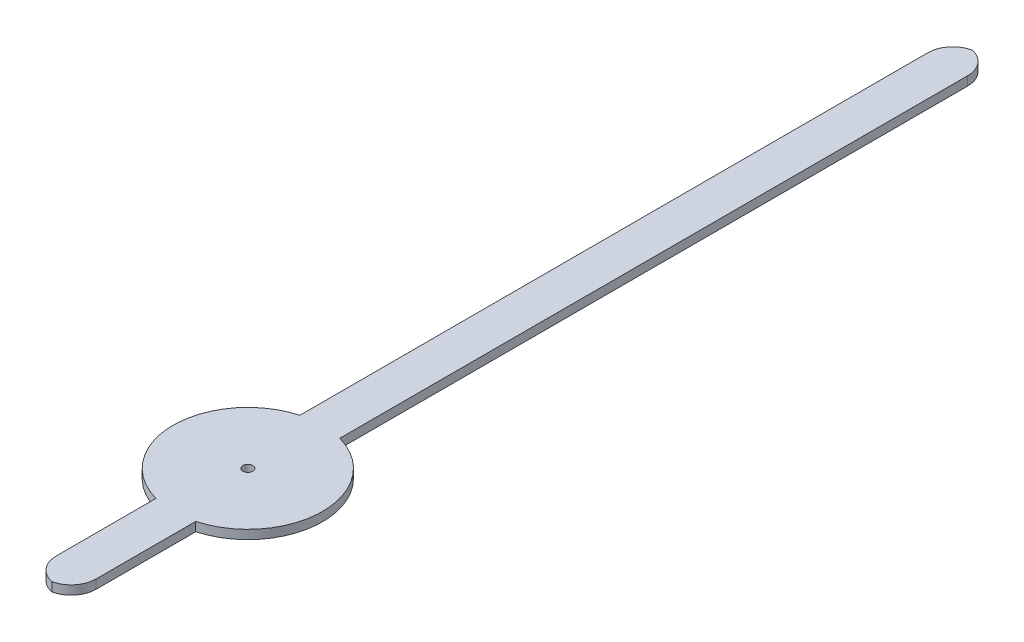
ISO-10303-21;
HEADER;
FILE_DESCRIPTION(('STEP AP214'),'2;1');
FILE_NAME('part.step','',(''),(''),'','','');
FILE_SCHEMA(('AUTOMOTIVE_DESIGN { 1 0 10303 214 1 1 1 1 }'));
ENDSEC;
DATA;
#1=APPLICATION_CONTEXT('core data for automotive mechanical design processes');
#2=APPLICATION_PROTOCOL_DEFINITION('international standard','automotive_design',2000,#1);
#3=PRODUCT_CONTEXT('',#1,'mechanical');
#4=PRODUCT('Part','Part','',(#3));
#5=PRODUCT_RELATED_PRODUCT_CATEGORY('part','',(#4));
#6=PRODUCT_DEFINITION_FORMATION('','',#4);
#7=PRODUCT_DEFINITION_CONTEXT('part definition',#1,'design');
#8=PRODUCT_DEFINITION('design','',#6,#7);
#9=PRODUCT_DEFINITION_SHAPE('','',#8);
#10=(LENGTH_UNIT() NAMED_UNIT(*) SI_UNIT(.MILLI.,.METRE.));
#11=(NAMED_UNIT(*) PLANE_ANGLE_UNIT() SI_UNIT($,.RADIAN.));
#12=(NAMED_UNIT(*) SI_UNIT($,.STERADIAN.) SOLID_ANGLE_UNIT());
#13=UNCERTAINTY_MEASURE_WITH_UNIT(LENGTH_MEASURE(1.E-05),#10,'distance_accuracy_value','');
#14=(GEOMETRIC_REPRESENTATION_CONTEXT(3) GLOBAL_UNCERTAINTY_ASSIGNED_CONTEXT((#13)) GLOBAL_UNIT_ASSIGNED_CONTEXT((#10,
#11,#12)) REPRESENTATION_CONTEXT('',''));
#15=CARTESIAN_POINT('',(0.,0.,0.));
#16=DIRECTION('',(0.,0.,1.));
#17=DIRECTION('',(1.,0.,0.));
#18=AXIS2_PLACEMENT_3D('',#15,#16,#17);
#19=CARTESIAN_POINT('',(0.,0.18,0.));
#20=DIRECTION('',(0.,1.,0.));
#21=DIRECTION('',(0.,0.,1.));
#22=AXIS2_PLACEMENT_3D('',#19,#20,#21);
#23=PLANE('',#22);
#24=CARTESIAN_POINT('',(-0.0999999999999999,0.18,-14.0543167705199));
#25=DIRECTION('',(0.,1.,0.));
#26=DIRECTION('',(0.,0.,1.));
#27=AXIS2_PLACEMENT_3D('',#24,#25,#26);
#28=CIRCLE('',#27,0.5);
#29=CARTESIAN_POINT('',(0.4,0.18,-14.0543167705199));
#30=VERTEX_POINT('',#29);
#31=CARTESIAN_POINT('',(0.,0.18,-14.5442147190765));
#32=VERTEX_POINT('',#31);
#33=EDGE_CURVE('E61',#30,#32,#28,.T.);
#34=ORIENTED_EDGE('',*,*,#33,.T.);
#35=CARTESIAN_POINT('',(0.0999999999999999,0.18,-14.0543167705199));
#36=DIRECTION('',(0.,1.,0.));
#37=DIRECTION('',(0.,0.,1.));
#38=AXIS2_PLACEMENT_3D('',#35,#36,#37);
#39=CIRCLE('',#38,0.5);
#40=CARTESIAN_POINT('',(-0.4,0.18,-14.0543167705199));
#41=VERTEX_POINT('',#40);
#42=EDGE_CURVE('E212',#32,#41,#39,.T.);
#43=ORIENTED_EDGE('',*,*,#42,.T.);
#44=DIRECTION('',(0.,0.,1.));
#45=VECTOR('',#44,1.);
#46=CARTESIAN_POINT('',(-0.4,0.18,-1.4456832294801));
#47=LINE('',#46,#45);
#48=CARTESIAN_POINT('',(-0.4,0.18,-1.4456832294801));
#49=VERTEX_POINT('',#48);
#50=EDGE_CURVE('E150',#41,#49,#47,.T.);
#51=ORIENTED_EDGE('',*,*,#50,.T.);
#52=CARTESIAN_POINT('',(0.,0.18,0.));
#53=DIRECTION('',(0.,1.,0.));
#54=DIRECTION('',(0.,0.,1.));
#55=AXIS2_PLACEMENT_3D('',#52,#53,#54);
#56=CIRCLE('',#55,1.5);
#57=CARTESIAN_POINT('',(-0.4,0.18,1.4456832294801));
#58=VERTEX_POINT('',#57);
#59=EDGE_CURVE('E156',#49,#58,#56,.T.);
#60=ORIENTED_EDGE('',*,*,#59,.T.);
#61=DIRECTION('',(0.,0.,1.));
#62=VECTOR('',#61,1.);
#63=CARTESIAN_POINT('',(-0.4,0.18,3.9456832294801));
#64=LINE('',#63,#62);
#65=CARTESIAN_POINT('',(-0.4,0.18,3.4456832294801));
#66=VERTEX_POINT('',#65);
#67=EDGE_CURVE('E159',#58,#66,#64,.T.);
#68=ORIENTED_EDGE('',*,*,#67,.T.);
#69=CARTESIAN_POINT('',(0.0999999999999998,0.18,3.4456832294801));
#70=DIRECTION('',(0.,1.,0.));
#71=DIRECTION('',(0.,0.,1.));
#72=AXIS2_PLACEMENT_3D('',#69,#70,#71);
#73=CIRCLE('',#72,0.5);
#74=CARTESIAN_POINT('',(0.,0.18,3.93558117803673));
#75=VERTEX_POINT('',#74);
#76=EDGE_CURVE('E68',#66,#75,#73,.T.);
#77=ORIENTED_EDGE('',*,*,#76,.T.);
#78=CARTESIAN_POINT('',(-0.0999999999999999,0.18,3.4456832294801));
#79=DIRECTION('',(0.,1.,0.));
#80=DIRECTION('',(0.,0.,1.));
#81=AXIS2_PLACEMENT_3D('',#78,#79,#80);
#82=CIRCLE('',#81,0.5);
#83=CARTESIAN_POINT('',(0.4,0.18,3.4456832294801));
#84=VERTEX_POINT('',#83);
#85=EDGE_CURVE('E126',#75,#84,#82,.T.);
#86=ORIENTED_EDGE('',*,*,#85,.T.);
#87=DIRECTION('',(0.,0.,-1.));
#88=VECTOR('',#87,1.);
#89=CARTESIAN_POINT('',(0.4,0.18,3.9456832294801));
#90=LINE('',#89,#88);
#91=CARTESIAN_POINT('',(0.4,0.18,1.4456832294801));
#92=VERTEX_POINT('',#91);
#93=EDGE_CURVE('E120',#84,#92,#90,.T.);
#94=ORIENTED_EDGE('',*,*,#93,.T.);
#95=CARTESIAN_POINT('',(0.,0.18,0.));
#96=DIRECTION('',(0.,1.,0.));
#97=DIRECTION('',(0.,0.,1.));
#98=AXIS2_PLACEMENT_3D('',#95,#96,#97);
#99=CIRCLE('',#98,1.5);
#100=CARTESIAN_POINT('',(0.4,0.18,-1.4456832294801));
#101=VERTEX_POINT('',#100);
#102=EDGE_CURVE('E124',#92,#101,#99,.T.);
#103=ORIENTED_EDGE('',*,*,#102,.T.);
#104=DIRECTION('',(0.,0.,-1.));
#105=VECTOR('',#104,1.);
#106=CARTESIAN_POINT('',(0.4,0.18,-1.4456832294801));
#107=LINE('',#106,#105);
#108=EDGE_CURVE('E147',#101,#30,#107,.T.);
#109=ORIENTED_EDGE('',*,*,#108,.T.);
#110=EDGE_LOOP('',(#34,#43,#51,#60,#68,#77,#86,#94,#103,#109));
#111=FACE_BOUND('',#110,.T.);
#112=CARTESIAN_POINT('',(0.,0.18,0.));
#113=DIRECTION('',(0.,1.,0.));
#114=DIRECTION('',(0.,0.,1.));
#115=AXIS2_PLACEMENT_3D('',#112,#113,#114);
#116=CIRCLE('',#115,0.1);
#117=CARTESIAN_POINT('',(0.,0.18,0.1));
#118=VERTEX_POINT('',#117);
#119=EDGE_CURVE('E166',#118,#118,#116,.T.);
#120=ORIENTED_EDGE('',*,*,#119,.F.);
#121=EDGE_LOOP('',(#120));
#122=FACE_BOUND('',#121,.T.);
#123=ADVANCED_FACE('F43',(#111,#122),#23,.T.);
#124=CARTESIAN_POINT('',(0.,0.,0.));
#125=DIRECTION('',(0.,1.,0.));
#126=DIRECTION('',(0.,0.,1.));
#127=AXIS2_PLACEMENT_3D('',#124,#125,#126);
#128=PLANE('',#127);
#129=DIRECTION('',(0.,0.,1.));
#130=VECTOR('',#129,1.);
#131=CARTESIAN_POINT('',(-0.4,0.,-1.4456832294801));
#132=LINE('',#131,#130);
#133=CARTESIAN_POINT('',(-0.4,0.,-14.0543167705199));
#134=VERTEX_POINT('',#133);
#135=CARTESIAN_POINT('',(-0.4,0.,-1.4456832294801));
#136=VERTEX_POINT('',#135);
#137=EDGE_CURVE('E173',#134,#136,#132,.T.);
#138=ORIENTED_EDGE('',*,*,#137,.F.);
#139=CARTESIAN_POINT('',(0.0999999999999999,0.,-14.0543167705199));
#140=DIRECTION('',(0.,1.,0.));
#141=DIRECTION('',(0.,0.,1.));
#142=AXIS2_PLACEMENT_3D('',#139,#140,#141);
#143=CIRCLE('',#142,0.5);
#144=CARTESIAN_POINT('',(0.,0.,-14.5442147190765));
#145=VERTEX_POINT('',#144);
#146=EDGE_CURVE('E203',#134,#145,#143,.F.);
#147=ORIENTED_EDGE('',*,*,#146,.T.);
#148=CARTESIAN_POINT('',(-0.0999999999999999,0.,-14.0543167705199));
#149=DIRECTION('',(0.,1.,0.));
#150=DIRECTION('',(0.,0.,1.));
#151=AXIS2_PLACEMENT_3D('',#148,#149,#150);
#152=CIRCLE('',#151,0.5);
#153=CARTESIAN_POINT('',(0.4,0.,-14.0543167705199));
#154=VERTEX_POINT('',#153);
#155=EDGE_CURVE('E200',#145,#154,#152,.F.);
#156=ORIENTED_EDGE('',*,*,#155,.T.);
#157=DIRECTION('',(0.,0.,-1.));
#158=VECTOR('',#157,1.);
#159=CARTESIAN_POINT('',(0.4,0.,-1.4456832294801));
#160=LINE('',#159,#158);
#161=CARTESIAN_POINT('',(0.4,0.,-1.4456832294801));
#162=VERTEX_POINT('',#161);
#163=EDGE_CURVE('E169',#162,#154,#160,.T.);
#164=ORIENTED_EDGE('',*,*,#163,.F.);
#165=CARTESIAN_POINT('',(0.,0.,0.));
#166=DIRECTION('',(0.,1.,0.));
#167=DIRECTION('',(0.,0.,1.));
#168=AXIS2_PLACEMENT_3D('',#165,#166,#167);
#169=CIRCLE('',#168,1.5);
#170=CARTESIAN_POINT('',(0.4,0.,1.4456832294801));
#171=VERTEX_POINT('',#170);
#172=EDGE_CURVE('E165',#171,#162,#169,.T.);
#173=ORIENTED_EDGE('',*,*,#172,.F.);
#174=DIRECTION('',(0.,0.,-1.));
#175=VECTOR('',#174,1.);
#176=CARTESIAN_POINT('',(0.4,0.,3.9456832294801));
#177=LINE('',#176,#175);
#178=CARTESIAN_POINT('',(0.4,0.,3.4456832294801));
#179=VERTEX_POINT('',#178);
#180=EDGE_CURVE('E136',#179,#171,#177,.T.);
#181=ORIENTED_EDGE('',*,*,#180,.F.);
#182=CARTESIAN_POINT('',(-0.0999999999999999,0.,3.4456832294801));
#183=DIRECTION('',(0.,1.,0.));
#184=DIRECTION('',(0.,0.,1.));
#185=AXIS2_PLACEMENT_3D('',#182,#183,#184);
#186=CIRCLE('',#185,0.5);
#187=CARTESIAN_POINT('',(0.,0.,3.93558117803673));
#188=VERTEX_POINT('',#187);
#189=EDGE_CURVE('E194',#179,#188,#186,.F.);
#190=ORIENTED_EDGE('',*,*,#189,.T.);
#191=CARTESIAN_POINT('',(0.0999999999999998,0.,3.4456832294801));
#192=DIRECTION('',(0.,1.,0.));
#193=DIRECTION('',(0.,0.,1.));
#194=AXIS2_PLACEMENT_3D('',#191,#192,#193);
#195=CIRCLE('',#194,0.5);
#196=CARTESIAN_POINT('',(-0.4,0.,3.4456832294801));
#197=VERTEX_POINT('',#196);
#198=EDGE_CURVE('E197',#188,#197,#195,.F.);
#199=ORIENTED_EDGE('',*,*,#198,.T.);
#200=DIRECTION('',(0.,0.,1.));
#201=VECTOR('',#200,1.);
#202=CARTESIAN_POINT('',(-0.4,0.,3.9456832294801));
#203=LINE('',#202,#201);
#204=CARTESIAN_POINT('',(-0.4,0.,1.4456832294801));
#205=VERTEX_POINT('',#204);
#206=EDGE_CURVE('E130',#205,#197,#203,.T.);
#207=ORIENTED_EDGE('',*,*,#206,.F.);
#208=CARTESIAN_POINT('',(0.,0.,0.));
#209=DIRECTION('',(0.,1.,0.));
#210=DIRECTION('',(0.,0.,1.));
#211=AXIS2_PLACEMENT_3D('',#208,#209,#210);
#212=CIRCLE('',#211,1.5);
#213=EDGE_CURVE('E176',#136,#205,#212,.T.);
#214=ORIENTED_EDGE('',*,*,#213,.F.);
#215=EDGE_LOOP('',(#138,#147,#156,#164,#173,#181,#190,#199,#207,#214));
#216=FACE_BOUND('',#215,.T.);
#217=CARTESIAN_POINT('',(0.,0.,0.));
#218=DIRECTION('',(0.,1.,0.));
#219=DIRECTION('',(0.,0.,1.));
#220=AXIS2_PLACEMENT_3D('',#217,#218,#219);
#221=CIRCLE('',#220,0.1);
#222=CARTESIAN_POINT('',(0.,0.,0.1));
#223=VERTEX_POINT('',#222);
#224=EDGE_CURVE('E223',#223,#223,#221,.T.);
#225=ORIENTED_EDGE('',*,*,#224,.T.);
#226=EDGE_LOOP('',(#225));
#227=FACE_BOUND('',#226,.T.);
#228=ADVANCED_FACE('F239',(#216,#227),#128,.F.);
#229=CARTESIAN_POINT('',(0.4,0.18,3.9456832294801));
#230=DIRECTION('',(-1.,0.,0.));
#231=DIRECTION('',(0.,0.,1.));
#232=AXIS2_PLACEMENT_3D('',#229,#230,#231);
#233=PLANE('',#232);
#234=ORIENTED_EDGE('',*,*,#93,.F.);
#235=DIRECTION('',(0.,-1.,0.));
#236=VECTOR('',#235,1.);
#237=CARTESIAN_POINT('',(0.4,0.18,3.4456832294801));
#238=LINE('',#237,#236);
#239=EDGE_CURVE('E11',#84,#179,#238,.T.);
#240=ORIENTED_EDGE('',*,*,#239,.T.);
#241=ORIENTED_EDGE('',*,*,#180,.T.);
#242=DIRECTION('',(0.,-1.,0.));
#243=VECTOR('',#242,1.);
#244=CARTESIAN_POINT('',(0.4,0.18,1.4456832294801));
#245=LINE('',#244,#243);
#246=EDGE_CURVE('E133',#92,#171,#245,.T.);
#247=ORIENTED_EDGE('',*,*,#246,.F.);
#248=EDGE_LOOP('',(#234,#240,#241,#247));
#249=FACE_BOUND('',#248,.T.);
#250=ADVANCED_FACE('F134',(#249),#233,.F.);
#251=CARTESIAN_POINT('',(0.,0.18,0.));
#252=DIRECTION('',(0.,-1.,0.));
#253=DIRECTION('',(0.,0.,-1.));
#254=AXIS2_PLACEMENT_3D('',#251,#252,#253);
#255=CYLINDRICAL_SURFACE('',#254,1.5);
#256=ORIENTED_EDGE('',*,*,#172,.T.);
#257=DIRECTION('',(0.,-1.,0.));
#258=VECTOR('',#257,1.);
#259=CARTESIAN_POINT('',(0.4,0.18,-1.4456832294801));
#260=LINE('',#259,#258);
#261=EDGE_CURVE('E141',#101,#162,#260,.T.);
#262=ORIENTED_EDGE('',*,*,#261,.F.);
#263=ORIENTED_EDGE('',*,*,#102,.F.);
#264=ORIENTED_EDGE('',*,*,#246,.T.);
#265=EDGE_LOOP('',(#256,#262,#263,#264));
#266=FACE_BOUND('',#265,.T.);
#267=ADVANCED_FACE('F143',(#266),#255,.T.);
#268=CARTESIAN_POINT('',(0.4,0.18,-1.4456832294801));
#269=DIRECTION('',(-1.,0.,0.));
#270=DIRECTION('',(0.,0.,1.));
#271=AXIS2_PLACEMENT_3D('',#268,#269,#270);
#272=PLANE('',#271);
#273=ORIENTED_EDGE('',*,*,#163,.T.);
#274=DIRECTION('',(0.,-1.,0.));
#275=VECTOR('',#274,1.);
#276=CARTESIAN_POINT('',(0.4,0.18,-14.0543167705199));
#277=LINE('',#276,#275);
#278=EDGE_CURVE('E215',#154,#30,#277,.F.);
#279=ORIENTED_EDGE('',*,*,#278,.T.);
#280=ORIENTED_EDGE('',*,*,#108,.F.);
#281=ORIENTED_EDGE('',*,*,#261,.T.);
#282=EDGE_LOOP('',(#273,#279,#280,#281));
#283=FACE_BOUND('',#282,.T.);
#284=ADVANCED_FACE('F243',(#283),#272,.F.);
#285=CARTESIAN_POINT('',(-0.4,0.18,-1.4456832294801));
#286=DIRECTION('',(1.,0.,0.));
#287=DIRECTION('',(0.,0.,-1.));
#288=AXIS2_PLACEMENT_3D('',#285,#286,#287);
#289=PLANE('',#288);
#290=ORIENTED_EDGE('',*,*,#50,.F.);
#291=DIRECTION('',(0.,-1.,0.));
#292=VECTOR('',#291,1.);
#293=CARTESIAN_POINT('',(-0.4,0.18,-14.0543167705199));
#294=LINE('',#293,#292);
#295=EDGE_CURVE('E140',#41,#134,#294,.T.);
#296=ORIENTED_EDGE('',*,*,#295,.T.);
#297=ORIENTED_EDGE('',*,*,#137,.T.);
#298=DIRECTION('',(0.,-1.,0.));
#299=VECTOR('',#298,1.);
#300=CARTESIAN_POINT('',(-0.4,0.18,-1.4456832294801));
#301=LINE('',#300,#299);
#302=EDGE_CURVE('E185',#49,#136,#301,.T.);
#303=ORIENTED_EDGE('',*,*,#302,.F.);
#304=EDGE_LOOP('',(#290,#296,#297,#303));
#305=FACE_BOUND('',#304,.T.);
#306=ADVANCED_FACE('F253',(#305),#289,.F.);
#307=CARTESIAN_POINT('',(0.,0.18,0.));
#308=DIRECTION('',(0.,-1.,0.));
#309=DIRECTION('',(0.,0.,-1.));
#310=AXIS2_PLACEMENT_3D('',#307,#308,#309);
#311=CYLINDRICAL_SURFACE('',#310,1.5);
#312=ORIENTED_EDGE('',*,*,#213,.T.);
#313=DIRECTION('',(0.,-1.,0.));
#314=VECTOR('',#313,1.);
#315=CARTESIAN_POINT('',(-0.4,0.18,1.4456832294801));
#316=LINE('',#315,#314);
#317=EDGE_CURVE('E162',#58,#205,#316,.T.);
#318=ORIENTED_EDGE('',*,*,#317,.F.);
#319=ORIENTED_EDGE('',*,*,#59,.F.);
#320=ORIENTED_EDGE('',*,*,#302,.T.);
#321=EDGE_LOOP('',(#312,#318,#319,#320));
#322=FACE_BOUND('',#321,.T.);
#323=ADVANCED_FACE('F258',(#322),#311,.T.);
#324=CARTESIAN_POINT('',(-0.4,0.18,3.9456832294801));
#325=DIRECTION('',(1.,0.,0.));
#326=DIRECTION('',(0.,0.,-1.));
#327=AXIS2_PLACEMENT_3D('',#324,#325,#326);
#328=PLANE('',#327);
#329=ORIENTED_EDGE('',*,*,#206,.T.);
#330=DIRECTION('',(0.,-1.,0.));
#331=VECTOR('',#330,1.);
#332=CARTESIAN_POINT('',(-0.4,0.18,3.4456832294801));
#333=LINE('',#332,#331);
#334=EDGE_CURVE('E53',#197,#66,#333,.F.);
#335=ORIENTED_EDGE('',*,*,#334,.T.);
#336=ORIENTED_EDGE('',*,*,#67,.F.);
#337=ORIENTED_EDGE('',*,*,#317,.T.);
#338=EDGE_LOOP('',(#329,#335,#336,#337));
#339=FACE_BOUND('',#338,.T.);
#340=ADVANCED_FACE('F261',(#339),#328,.F.);
#341=CARTESIAN_POINT('',(0.,0.18,0.));
#342=DIRECTION('',(0.,-1.,0.));
#343=DIRECTION('',(0.,0.,-1.));
#344=AXIS2_PLACEMENT_3D('',#341,#342,#343);
#345=CYLINDRICAL_SURFACE('',#344,0.1);
#346=ORIENTED_EDGE('',*,*,#119,.T.);
#347=EDGE_LOOP('',(#346));
#348=FACE_BOUND('',#347,.T.);
#349=ORIENTED_EDGE('',*,*,#224,.F.);
#350=EDGE_LOOP('',(#349));
#351=FACE_BOUND('',#350,.T.);
#352=ADVANCED_FACE('F264',(#348,#351),#345,.F.);
#353=CARTESIAN_POINT('',(-0.0999999999999999,0.18,-14.0543167705199));
#354=DIRECTION('',(0.,-1.,0.));
#355=DIRECTION('',(0.,0.,-1.));
#356=AXIS2_PLACEMENT_3D('',#353,#354,#355);
#357=CYLINDRICAL_SURFACE('',#356,0.5);
#358=DIRECTION('',(0.,-1.,0.));
#359=VECTOR('',#358,1.);
#360=CARTESIAN_POINT('',(0.,0.09,-14.5442147190765));
#361=LINE('',#360,#359);
#362=EDGE_CURVE('E220',#32,#145,#361,.T.);
#363=ORIENTED_EDGE('',*,*,#362,.F.);
#364=ORIENTED_EDGE('',*,*,#33,.F.);
#365=ORIENTED_EDGE('',*,*,#278,.F.);
#366=ORIENTED_EDGE('',*,*,#155,.F.);
#367=EDGE_LOOP('',(#363,#364,#365,#366));
#368=FACE_BOUND('',#367,.T.);
#369=ADVANCED_FACE('F246',(#368),#357,.T.);
#370=CARTESIAN_POINT('',(0.0999999999999999,0.18,-14.0543167705199));
#371=DIRECTION('',(0.,-1.,0.));
#372=DIRECTION('',(0.,0.,-1.));
#373=AXIS2_PLACEMENT_3D('',#370,#371,#372);
#374=CYLINDRICAL_SURFACE('',#373,0.5);
#375=ORIENTED_EDGE('',*,*,#42,.F.);
#376=ORIENTED_EDGE('',*,*,#362,.T.);
#377=ORIENTED_EDGE('',*,*,#146,.F.);
#378=ORIENTED_EDGE('',*,*,#295,.F.);
#379=EDGE_LOOP('',(#375,#376,#377,#378));
#380=FACE_BOUND('',#379,.T.);
#381=ADVANCED_FACE('F249',(#380),#374,.T.);
#382=CARTESIAN_POINT('',(-0.0999999999999999,0.18,3.4456832294801));
#383=DIRECTION('',(0.,-1.,0.));
#384=DIRECTION('',(0.,0.,-1.));
#385=AXIS2_PLACEMENT_3D('',#382,#383,#384);
#386=CYLINDRICAL_SURFACE('',#385,0.5);
#387=ORIENTED_EDGE('',*,*,#239,.F.);
#388=ORIENTED_EDGE('',*,*,#85,.F.);
#389=DIRECTION('',(0.,-1.,0.));
#390=VECTOR('',#389,1.);
#391=CARTESIAN_POINT('',(0.,0.09,3.93558117803673));
#392=LINE('',#391,#390);
#393=EDGE_CURVE('E47',#188,#75,#392,.F.);
#394=ORIENTED_EDGE('',*,*,#393,.F.);
#395=ORIENTED_EDGE('',*,*,#189,.F.);
#396=EDGE_LOOP('',(#387,#388,#394,#395));
#397=FACE_BOUND('',#396,.T.);
#398=ADVANCED_FACE('F45',(#397),#386,.T.);
#399=CARTESIAN_POINT('',(0.0999999999999998,0.18,3.4456832294801));
#400=DIRECTION('',(0.,-1.,0.));
#401=DIRECTION('',(0.,0.,-1.));
#402=AXIS2_PLACEMENT_3D('',#399,#400,#401);
#403=CYLINDRICAL_SURFACE('',#402,0.5);
#404=ORIENTED_EDGE('',*,*,#76,.F.);
#405=ORIENTED_EDGE('',*,*,#334,.F.);
#406=ORIENTED_EDGE('',*,*,#198,.F.);
#407=ORIENTED_EDGE('',*,*,#393,.T.);
#408=EDGE_LOOP('',(#404,#405,#406,#407));
#409=FACE_BOUND('',#408,.T.);
#410=ADVANCED_FACE('F233',(#409),#403,.T.);
#411=CLOSED_SHELL('',(#123,#228,#250,#267,#284,#306,#323,#340,#352,#369,#381,#398,#410));
#412=MANIFOLD_SOLID_BREP('B2',#411);
#413=ADVANCED_BREP_SHAPE_REPRESENTATION('',(#18,#412),#14);
#414=SHAPE_DEFINITION_REPRESENTATION(#9,#413);
ENDSEC;
END-ISO-10303-21;
